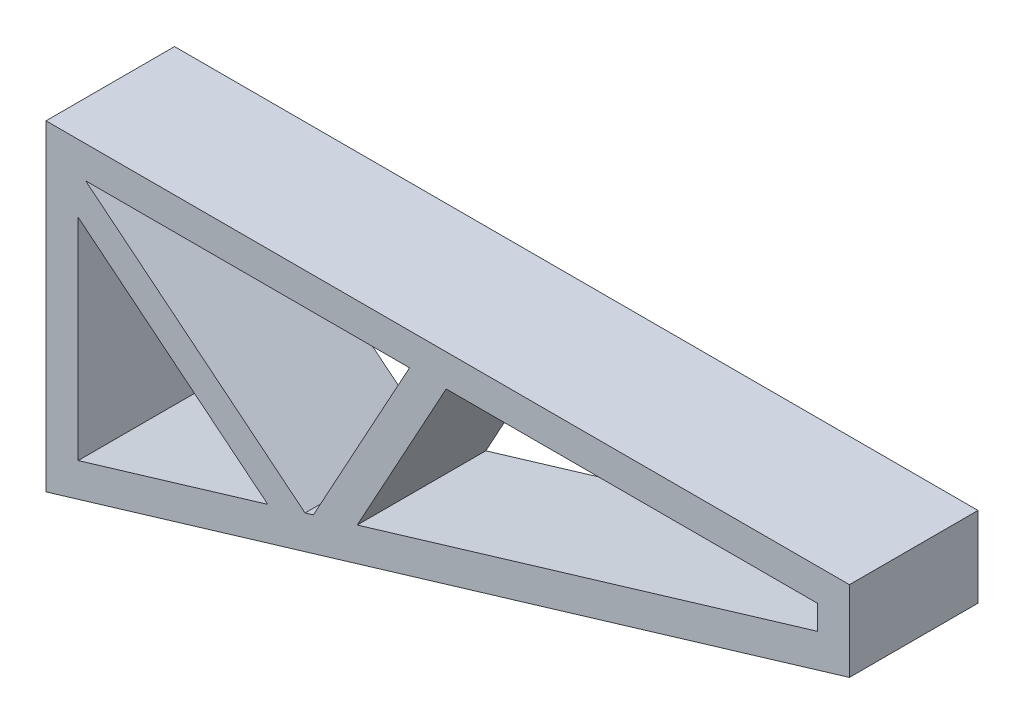
ISO-10303-21;
HEADER;
FILE_DESCRIPTION(('STEP AP214'),'2;1');
FILE_NAME('part.step','',(''),(''),'','','');
FILE_SCHEMA(('AUTOMOTIVE_DESIGN { 1 0 10303 214 1 1 1 1 }'));
ENDSEC;
DATA;
#1=APPLICATION_CONTEXT('core data for automotive mechanical design processes');
#2=APPLICATION_PROTOCOL_DEFINITION('international standard','automotive_design',2000,#1);
#3=PRODUCT_CONTEXT('',#1,'mechanical');
#4=PRODUCT('Part','Part','',(#3));
#5=PRODUCT_RELATED_PRODUCT_CATEGORY('part','',(#4));
#6=PRODUCT_DEFINITION_FORMATION('','',#4);
#7=PRODUCT_DEFINITION_CONTEXT('part definition',#1,'design');
#8=PRODUCT_DEFINITION('design','',#6,#7);
#9=PRODUCT_DEFINITION_SHAPE('','',#8);
#10=(LENGTH_UNIT() NAMED_UNIT(*) SI_UNIT(.MILLI.,.METRE.));
#11=(NAMED_UNIT(*) PLANE_ANGLE_UNIT() SI_UNIT($,.RADIAN.));
#12=(NAMED_UNIT(*) SI_UNIT($,.STERADIAN.) SOLID_ANGLE_UNIT());
#13=UNCERTAINTY_MEASURE_WITH_UNIT(LENGTH_MEASURE(1.E-05),#10,'distance_accuracy_value','');
#14=(GEOMETRIC_REPRESENTATION_CONTEXT(3) GLOBAL_UNCERTAINTY_ASSIGNED_CONTEXT((#13)) GLOBAL_UNIT_ASSIGNED_CONTEXT((#10,
#11,#12)) REPRESENTATION_CONTEXT('',''));
#15=CARTESIAN_POINT('',(0.,0.,0.));
#16=DIRECTION('',(0.,0.,1.));
#17=DIRECTION('',(1.,0.,0.));
#18=AXIS2_PLACEMENT_3D('',#15,#16,#17);
#19=CARTESIAN_POINT('',(42.6245438645254,52.5508075042094,20.));
#20=DIRECTION('',(0.629942664705403,0.77664164141762,0.));
#21=DIRECTION('',(-0.77664164141762,0.629942664705403,0.));
#22=AXIS2_PLACEMENT_3D('',#19,#20,#21);
#23=PLANE('',#22);
#24=DIRECTION('',(0.77664164141762,-0.629942664705403,0.));
#25=VECTOR('',#24,1.);
#26=CARTESIAN_POINT('',(42.6245438645254,52.5508075042094,-20.));
#27=LINE('',#26,#25);
#28=CARTESIAN_POINT('',(10.,79.0129375276578,-20.));
#29=VERTEX_POINT('',#28);
#30=CARTESIAN_POINT('',(69.0153679168725,31.1449168839723,-20.));
#31=VERTEX_POINT('',#30);
#32=EDGE_CURVE('E164',#29,#31,#27,.T.);
#33=ORIENTED_EDGE('',*,*,#32,.T.);
#34=DIRECTION('',(0.,0.,-1.));
#35=VECTOR('',#34,1.);
#36=CARTESIAN_POINT('',(69.0153679168725,31.1449168839723,20.));
#37=LINE('',#36,#35);
#38=CARTESIAN_POINT('',(69.0153679168725,31.1449168839723,20.));
#39=VERTEX_POINT('',#38);
#40=EDGE_CURVE('E12',#39,#31,#37,.T.);
#41=ORIENTED_EDGE('',*,*,#40,.F.);
#42=DIRECTION('',(0.77664164141762,-0.629942664705403,0.));
#43=VECTOR('',#42,1.);
#44=CARTESIAN_POINT('',(42.6245438645254,52.5508075042094,20.));
#45=LINE('',#44,#43);
#46=CARTESIAN_POINT('',(10.,79.0129375276578,20.));
#47=VERTEX_POINT('',#46);
#48=EDGE_CURVE('E154',#47,#39,#45,.T.);
#49=ORIENTED_EDGE('',*,*,#48,.F.);
#50=DIRECTION('',(0.,0.,-1.));
#51=VECTOR('',#50,1.);
#52=CARTESIAN_POINT('',(10.,79.0129375276578,20.));
#53=LINE('',#52,#51);
#54=EDGE_CURVE('E214',#47,#29,#53,.T.);
#55=ORIENTED_EDGE('',*,*,#54,.T.);
#56=EDGE_LOOP('',(#33,#41,#49,#55));
#57=FACE_BOUND('',#56,.T.);
#58=ADVANCED_FACE('F43',(#57),#23,.F.);
#59=CARTESIAN_POINT('',(-2.87347885566346,9.57826285221151,20.));
#60=DIRECTION('',(-0.287347885566345,0.957826285221151,0.));
#61=DIRECTION('',(-0.957826285221151,-0.287347885566345,0.));
#62=AXIS2_PLACEMENT_3D('',#59,#60,#61);
#63=PLANE('',#62);
#64=DIRECTION('',(0.957826285221151,0.287347885566345,0.));
#65=VECTOR('',#64,1.);
#66=CARTESIAN_POINT('',(-2.87347885566346,9.57826285221151,-20.));
#67=LINE('',#66,#65);
#68=CARTESIAN_POINT('',(10.,13.4403065089106,-20.));
#69=VERTEX_POINT('',#68);
#70=EDGE_CURVE('E210',#69,#31,#67,.T.);
#71=ORIENTED_EDGE('',*,*,#70,.F.);
#72=DIRECTION('',(0.,0.,-1.));
#73=VECTOR('',#72,1.);
#74=CARTESIAN_POINT('',(10.,13.4403065089106,20.));
#75=LINE('',#74,#73);
#76=CARTESIAN_POINT('',(10.,13.4403065089106,20.));
#77=VERTEX_POINT('',#76);
#78=EDGE_CURVE('E53',#77,#69,#75,.T.);
#79=ORIENTED_EDGE('',*,*,#78,.F.);
#80=DIRECTION('',(0.957826285221151,0.287347885566345,0.));
#81=VECTOR('',#80,1.);
#82=CARTESIAN_POINT('',(-2.87347885566346,9.57826285221151,20.));
#83=LINE('',#82,#81);
#84=EDGE_CURVE('E158',#77,#39,#83,.T.);
#85=ORIENTED_EDGE('',*,*,#84,.T.);
#86=ORIENTED_EDGE('',*,*,#40,.T.);
#87=EDGE_LOOP('',(#71,#79,#85,#86));
#88=FACE_BOUND('',#87,.T.);
#89=ADVANCED_FACE('F168',(#88),#63,.T.);
#90=CARTESIAN_POINT('',(0.,0.,20.));
#91=DIRECTION('',(-0.287347885566345,0.957826285221151,0.));
#92=DIRECTION('',(-0.957826285221151,-0.287347885566345,0.));
#93=AXIS2_PLACEMENT_3D('',#90,#91,#92);
#94=PLANE('',#93);
#95=DIRECTION('',(0.957826285221151,0.287347885566345,0.));
#96=VECTOR('',#95,1.);
#97=CARTESIAN_POINT('',(0.,0.,-20.));
#98=LINE('',#97,#96);
#99=CARTESIAN_POINT('',(0.,0.,-20.));
#100=VERTEX_POINT('',#99);
#101=CARTESIAN_POINT('',(250.,75.,-20.));
#102=VERTEX_POINT('',#101);
#103=EDGE_CURVE('E197',#100,#102,#98,.T.);
#104=ORIENTED_EDGE('',*,*,#103,.T.);
#105=DIRECTION('',(0.,0.,-1.));
#106=VECTOR('',#105,1.);
#107=CARTESIAN_POINT('',(250.,75.,20.));
#108=LINE('',#107,#106);
#109=CARTESIAN_POINT('',(250.,75.,20.));
#110=VERTEX_POINT('',#109);
#111=EDGE_CURVE('E216',#110,#102,#108,.T.);
#112=ORIENTED_EDGE('',*,*,#111,.F.);
#113=DIRECTION('',(0.957826285221151,0.287347885566345,0.));
#114=VECTOR('',#113,1.);
#115=CARTESIAN_POINT('',(0.,0.,20.));
#116=LINE('',#115,#114);
#117=CARTESIAN_POINT('',(0.,0.,20.));
#118=VERTEX_POINT('',#117);
#119=EDGE_CURVE('E465',#118,#110,#116,.T.);
#120=ORIENTED_EDGE('',*,*,#119,.F.);
#121=DIRECTION('',(0.,0.,-1.));
#122=VECTOR('',#121,1.);
#123=CARTESIAN_POINT('',(0.,0.,20.));
#124=LINE('',#123,#122);
#125=EDGE_CURVE('E218',#118,#100,#124,.T.);
#126=ORIENTED_EDGE('',*,*,#125,.T.);
#127=EDGE_LOOP('',(#104,#112,#120,#126));
#128=FACE_BOUND('',#127,.T.);
#129=ADVANCED_FACE('F274',(#128),#94,.F.);
#130=CARTESIAN_POINT('',(250.,0.,20.));
#131=DIRECTION('',(-1.,0.,0.));
#132=DIRECTION('',(0.,0.,1.));
#133=AXIS2_PLACEMENT_3D('',#130,#131,#132);
#134=PLANE('',#133);
#135=DIRECTION('',(0.,1.,0.));
#136=VECTOR('',#135,1.);
#137=CARTESIAN_POINT('',(250.,0.,-20.));
#138=LINE('',#137,#136);
#139=CARTESIAN_POINT('',(250.,100.,-20.));
#140=VERTEX_POINT('',#139);
#141=EDGE_CURVE('E200',#102,#140,#138,.T.);
#142=ORIENTED_EDGE('',*,*,#141,.T.);
#143=DIRECTION('',(0.,0.,-1.));
#144=VECTOR('',#143,1.);
#145=CARTESIAN_POINT('',(250.,100.,20.));
#146=LINE('',#145,#144);
#147=CARTESIAN_POINT('',(250.,100.,20.));
#148=VERTEX_POINT('',#147);
#149=EDGE_CURVE('E223',#148,#140,#146,.T.);
#150=ORIENTED_EDGE('',*,*,#149,.F.);
#151=DIRECTION('',(0.,1.,0.));
#152=VECTOR('',#151,1.);
#153=CARTESIAN_POINT('',(250.,0.,20.));
#154=LINE('',#153,#152);
#155=EDGE_CURVE('E468',#110,#148,#154,.T.);
#156=ORIENTED_EDGE('',*,*,#155,.F.);
#157=ORIENTED_EDGE('',*,*,#111,.T.);
#158=EDGE_LOOP('',(#142,#150,#156,#157));
#159=FACE_BOUND('',#158,.T.);
#160=ADVANCED_FACE('F282',(#159),#134,.F.);
#161=CARTESIAN_POINT('',(0.,100.,20.));
#162=DIRECTION('',(0.,1.,0.));
#163=DIRECTION('',(0.,0.,1.));
#164=AXIS2_PLACEMENT_3D('',#161,#162,#163);
#165=PLANE('',#164);
#166=DIRECTION('',(1.,0.,0.));
#167=VECTOR('',#166,1.);
#168=CARTESIAN_POINT('',(0.,100.,-20.));
#169=LINE('',#168,#167);
#170=CARTESIAN_POINT('',(0.,100.,-20.));
#171=VERTEX_POINT('',#170);
#172=EDGE_CURVE('E203',#171,#140,#169,.T.);
#173=ORIENTED_EDGE('',*,*,#172,.F.);
#174=DIRECTION('',(0.,0.,-1.));
#175=VECTOR('',#174,1.);
#176=CARTESIAN_POINT('',(0.,100.,20.));
#177=LINE('',#176,#175);
#178=CARTESIAN_POINT('',(0.,100.,20.));
#179=VERTEX_POINT('',#178);
#180=EDGE_CURVE('E220',#179,#171,#177,.T.);
#181=ORIENTED_EDGE('',*,*,#180,.F.);
#182=DIRECTION('',(1.,0.,0.));
#183=VECTOR('',#182,1.);
#184=CARTESIAN_POINT('',(0.,100.,20.));
#185=LINE('',#184,#183);
#186=EDGE_CURVE('E476',#179,#148,#185,.T.);
#187=ORIENTED_EDGE('',*,*,#186,.T.);
#188=ORIENTED_EDGE('',*,*,#149,.T.);
#189=EDGE_LOOP('',(#173,#181,#187,#188));
#190=FACE_BOUND('',#189,.T.);
#191=ADVANCED_FACE('F278',(#190),#165,.T.);
#192=CARTESIAN_POINT('',(-2.87347885566346,9.57826285221151,20.));
#193=DIRECTION('',(-0.287347885566345,0.957826285221151,0.));
#194=DIRECTION('',(-0.957826285221151,-0.287347885566345,0.));
#195=AXIS2_PLACEMENT_3D('',#192,#193,#194);
#196=PLANE('',#195);
#197=DIRECTION('',(0.957826285221151,0.287347885566345,0.));
#198=VECTOR('',#197,1.);
#199=CARTESIAN_POINT('',(-2.87347885566346,9.57826285221151,-20.));
#200=LINE('',#199,#198);
#201=CARTESIAN_POINT('',(80.6037241419805,34.6214237515047,-20.));
#202=VERTEX_POINT('',#201);
#203=CARTESIAN_POINT('',(83.2001001555763,35.4003365555834,-20.));
#204=VERTEX_POINT('',#203);
#205=EDGE_CURVE('E185',#202,#204,#200,.T.);
#206=ORIENTED_EDGE('',*,*,#205,.F.);
#207=DIRECTION('',(0.,0.,-1.));
#208=VECTOR('',#207,1.);
#209=CARTESIAN_POINT('',(80.6037241419805,34.6214237515047,20.));
#210=LINE('',#209,#208);
#211=CARTESIAN_POINT('',(80.6037241419805,34.6214237515047,20.));
#212=VERTEX_POINT('',#211);
#213=EDGE_CURVE('E221',#212,#202,#210,.T.);
#214=ORIENTED_EDGE('',*,*,#213,.F.);
#215=DIRECTION('',(0.957826285221151,0.287347885566345,0.));
#216=VECTOR('',#215,1.);
#217=CARTESIAN_POINT('',(-2.87347885566346,9.57826285221151,20.));
#218=LINE('',#217,#216);
#219=CARTESIAN_POINT('',(83.2001001555763,35.4003365555834,20.));
#220=VERTEX_POINT('',#219);
#221=EDGE_CURVE('E460',#212,#220,#218,.T.);
#222=ORIENTED_EDGE('',*,*,#221,.T.);
#223=DIRECTION('',(0.,0.,-1.));
#224=VECTOR('',#223,1.);
#225=CARTESIAN_POINT('',(83.2001001555763,35.4003365555834,20.));
#226=LINE('',#225,#224);
#227=EDGE_CURVE('E227',#220,#204,#226,.T.);
#228=ORIENTED_EDGE('',*,*,#227,.T.);
#229=EDGE_LOOP('',(#206,#214,#222,#228));
#230=FACE_BOUND('',#229,.T.);
#231=ADVANCED_FACE('F281',(#230),#196,.T.);
#232=CARTESIAN_POINT('',(48.9239705115794,60.3172239183856,20.));
#233=DIRECTION('',(0.629942664705403,0.77664164141762,0.));
#234=DIRECTION('',(-0.77664164141762,0.629942664705403,0.));
#235=AXIS2_PLACEMENT_3D('',#232,#233,#234);
#236=PLANE('',#235);
#237=DIRECTION('',(0.77664164141762,-0.629942664705403,0.));
#238=VECTOR('',#237,1.);
#239=CARTESIAN_POINT('',(48.9239705115794,60.3172239183856,-20.));
#240=LINE('',#239,#238);
#241=CARTESIAN_POINT('',(12.3287671232877,90.,-20.));
#242=VERTEX_POINT('',#241);
#243=EDGE_CURVE('E188',#242,#202,#240,.T.);
#244=ORIENTED_EDGE('',*,*,#243,.F.);
#245=DIRECTION('',(0.,0.,-1.));
#246=VECTOR('',#245,1.);
#247=CARTESIAN_POINT('',(12.3287671232877,90.,20.));
#248=LINE('',#247,#246);
#249=CARTESIAN_POINT('',(12.3287671232877,90.,20.));
#250=VERTEX_POINT('',#249);
#251=EDGE_CURVE('E231',#250,#242,#248,.T.);
#252=ORIENTED_EDGE('',*,*,#251,.F.);
#253=DIRECTION('',(0.77664164141762,-0.629942664705403,0.));
#254=VECTOR('',#253,1.);
#255=CARTESIAN_POINT('',(48.9239705115794,60.3172239183856,20.));
#256=LINE('',#255,#254);
#257=EDGE_CURVE('E488',#250,#212,#256,.T.);
#258=ORIENTED_EDGE('',*,*,#257,.T.);
#259=ORIENTED_EDGE('',*,*,#213,.T.);
#260=EDGE_LOOP('',(#244,#252,#258,#259));
#261=FACE_BOUND('',#260,.T.);
#262=ADVANCED_FACE('F296',(#261),#236,.T.);
#263=CARTESIAN_POINT('',(0.,90.,20.));
#264=DIRECTION('',(0.,1.,0.));
#265=DIRECTION('',(0.,0.,1.));
#266=AXIS2_PLACEMENT_3D('',#263,#264,#265);
#267=PLANE('',#266);
#268=DIRECTION('',(1.,0.,0.));
#269=VECTOR('',#268,1.);
#270=CARTESIAN_POINT('',(0.,90.,-20.));
#271=LINE('',#270,#269);
#272=CARTESIAN_POINT('',(113.117723960736,90.,-20.));
#273=VERTEX_POINT('',#272);
#274=EDGE_CURVE('E191',#242,#273,#271,.T.);
#275=ORIENTED_EDGE('',*,*,#274,.T.);
#276=DIRECTION('',(0.,0.,-1.));
#277=VECTOR('',#276,1.);
#278=CARTESIAN_POINT('',(113.117723960736,90.,20.));
#279=LINE('',#278,#277);
#280=CARTESIAN_POINT('',(113.117723960736,90.,20.));
#281=VERTEX_POINT('',#280);
#282=EDGE_CURVE('E229',#281,#273,#279,.T.);
#283=ORIENTED_EDGE('',*,*,#282,.F.);
#284=DIRECTION('',(1.,0.,0.));
#285=VECTOR('',#284,1.);
#286=CARTESIAN_POINT('',(0.,90.,20.));
#287=LINE('',#286,#285);
#288=EDGE_CURVE('E486',#250,#281,#287,.T.);
#289=ORIENTED_EDGE('',*,*,#288,.F.);
#290=ORIENTED_EDGE('',*,*,#251,.T.);
#291=EDGE_LOOP('',(#275,#283,#289,#290));
#292=FACE_BOUND('',#291,.T.);
#293=ADVANCED_FACE('F293',(#292),#267,.F.);
#294=CARTESIAN_POINT('',(-2.87347885566346,9.57826285221151,20.));
#295=DIRECTION('',(-0.287347885566345,0.957826285221151,0.));
#296=DIRECTION('',(-0.957826285221151,-0.287347885566345,0.));
#297=AXIS2_PLACEMENT_3D('',#294,#295,#296);
#298=PLANE('',#297);
#299=DIRECTION('',(0.957826285221151,0.287347885566345,0.));
#300=VECTOR('',#299,1.);
#301=CARTESIAN_POINT('',(-2.87347885566346,9.57826285221151,-20.));
#302=LINE('',#301,#300);
#303=CARTESIAN_POINT('',(96.8461026287938,39.4941372975487,-20.));
#304=VERTEX_POINT('',#303);
#305=CARTESIAN_POINT('',(240.,82.4403065089106,-20.));
#306=VERTEX_POINT('',#305);
#307=EDGE_CURVE('E174',#304,#306,#302,.T.);
#308=ORIENTED_EDGE('',*,*,#307,.F.);
#309=DIRECTION('',(0.,0.,-1.));
#310=VECTOR('',#309,1.);
#311=CARTESIAN_POINT('',(96.8461026287938,39.4941372975487,20.));
#312=LINE('',#311,#310);
#313=CARTESIAN_POINT('',(96.8461026287938,39.4941372975487,20.));
#314=VERTEX_POINT('',#313);
#315=EDGE_CURVE('E47',#314,#304,#312,.T.);
#316=ORIENTED_EDGE('',*,*,#315,.F.);
#317=DIRECTION('',(0.957826285221151,0.287347885566345,0.));
#318=VECTOR('',#317,1.);
#319=CARTESIAN_POINT('',(-2.87347885566346,9.57826285221151,20.));
#320=LINE('',#319,#318);
#321=CARTESIAN_POINT('',(240.,82.4403065089106,20.));
#322=VERTEX_POINT('',#321);
#323=EDGE_CURVE('E213',#314,#322,#320,.T.);
#324=ORIENTED_EDGE('',*,*,#323,.T.);
#325=DIRECTION('',(0.,0.,-1.));
#326=VECTOR('',#325,1.);
#327=CARTESIAN_POINT('',(240.,82.4403065089106,20.));
#328=LINE('',#327,#326);
#329=EDGE_CURVE('E170',#322,#306,#328,.T.);
#330=ORIENTED_EDGE('',*,*,#329,.T.);
#331=EDGE_LOOP('',(#308,#316,#324,#330));
#332=FACE_BOUND('',#331,.T.);
#333=ADVANCED_FACE('F45',(#332),#298,.T.);
#334=CARTESIAN_POINT('',(57.8395150815413,-31.692884976187,20.));
#335=DIRECTION('',(-0.876975739836019,0.480534651964942,0.));
#336=DIRECTION('',(-0.480534651964942,-0.876975739836019,0.));
#337=AXIS2_PLACEMENT_3D('',#334,#335,#336);
#338=PLANE('',#337);
#339=DIRECTION('',(0.480534651964942,0.876975739836019,0.));
#340=VECTOR('',#339,1.);
#341=CARTESIAN_POINT('',(57.8395150815413,-31.692884976187,-20.));
#342=LINE('',#341,#340);
#343=CARTESIAN_POINT('',(124.520547945205,90.,-20.));
#344=VERTEX_POINT('',#343);
#345=EDGE_CURVE('E177',#304,#344,#342,.T.);
#346=ORIENTED_EDGE('',*,*,#345,.T.);
#347=DIRECTION('',(0.,0.,-1.));
#348=VECTOR('',#347,1.);
#349=CARTESIAN_POINT('',(124.520547945205,90.,20.));
#350=LINE('',#349,#348);
#351=CARTESIAN_POINT('',(124.520547945205,90.,20.));
#352=VERTEX_POINT('',#351);
#353=EDGE_CURVE('E236',#352,#344,#350,.T.);
#354=ORIENTED_EDGE('',*,*,#353,.F.);
#355=DIRECTION('',(0.480534651964942,0.876975739836019,0.));
#356=VECTOR('',#355,1.);
#357=CARTESIAN_POINT('',(57.8395150815413,-31.692884976187,20.));
#358=LINE('',#357,#356);
#359=EDGE_CURVE('E245',#314,#352,#358,.T.);
#360=ORIENTED_EDGE('',*,*,#359,.F.);
#361=ORIENTED_EDGE('',*,*,#315,.T.);
#362=EDGE_LOOP('',(#346,#354,#360,#361));
#363=FACE_BOUND('',#362,.T.);
#364=ADVANCED_FACE('F244',(#363),#338,.F.);
#365=CARTESIAN_POINT('',(0.,90.,20.));
#366=DIRECTION('',(0.,1.,0.));
#367=DIRECTION('',(0.,0.,1.));
#368=AXIS2_PLACEMENT_3D('',#365,#366,#367);
#369=PLANE('',#368);
#370=DIRECTION('',(1.,0.,0.));
#371=VECTOR('',#370,1.);
#372=CARTESIAN_POINT('',(0.,90.,-20.));
#373=LINE('',#372,#371);
#374=CARTESIAN_POINT('',(240.,90.,-20.));
#375=VERTEX_POINT('',#374);
#376=EDGE_CURVE('E179',#344,#375,#373,.T.);
#377=ORIENTED_EDGE('',*,*,#376,.T.);
#378=DIRECTION('',(0.,0.,-1.));
#379=VECTOR('',#378,1.);
#380=CARTESIAN_POINT('',(240.,90.,20.));
#381=LINE('',#380,#379);
#382=CARTESIAN_POINT('',(240.,90.,20.));
#383=VERTEX_POINT('',#382);
#384=EDGE_CURVE('E235',#383,#375,#381,.T.);
#385=ORIENTED_EDGE('',*,*,#384,.F.);
#386=DIRECTION('',(1.,0.,0.));
#387=VECTOR('',#386,1.);
#388=CARTESIAN_POINT('',(0.,90.,20.));
#389=LINE('',#388,#387);
#390=EDGE_CURVE('E492',#352,#383,#389,.T.);
#391=ORIENTED_EDGE('',*,*,#390,.F.);
#392=ORIENTED_EDGE('',*,*,#353,.T.);
#393=EDGE_LOOP('',(#377,#385,#391,#392));
#394=FACE_BOUND('',#393,.T.);
#395=ADVANCED_FACE('F257',(#394),#369,.F.);
#396=CARTESIAN_POINT('',(0.,0.,20.));
#397=DIRECTION('',(-1.,0.,0.));
#398=DIRECTION('',(0.,0.,1.));
#399=AXIS2_PLACEMENT_3D('',#396,#397,#398);
#400=PLANE('',#399);
#401=DIRECTION('',(0.,1.,0.));
#402=VECTOR('',#401,1.);
#403=CARTESIAN_POINT('',(0.,0.,-20.));
#404=LINE('',#403,#402);
#405=EDGE_CURVE('E206',#100,#171,#404,.T.);
#406=ORIENTED_EDGE('',*,*,#405,.F.);
#407=ORIENTED_EDGE('',*,*,#125,.F.);
#408=DIRECTION('',(0.,1.,0.));
#409=VECTOR('',#408,1.);
#410=CARTESIAN_POINT('',(0.,0.,20.));
#411=LINE('',#410,#409);
#412=EDGE_CURVE('E160',#118,#179,#411,.T.);
#413=ORIENTED_EDGE('',*,*,#412,.T.);
#414=ORIENTED_EDGE('',*,*,#180,.T.);
#415=EDGE_LOOP('',(#406,#407,#413,#414));
#416=FACE_BOUND('',#415,.T.);
#417=ADVANCED_FACE('F259',(#416),#400,.T.);
#418=CARTESIAN_POINT('',(49.0697576831812,-26.8875384565376,20.));
#419=DIRECTION('',(-0.876975739836019,0.480534651964942,0.));
#420=DIRECTION('',(-0.480534651964942,-0.876975739836019,0.));
#421=AXIS2_PLACEMENT_3D('',#418,#419,#420);
#422=PLANE('',#421);
#423=DIRECTION('',(0.480534651964942,0.876975739836019,0.));
#424=VECTOR('',#423,1.);
#425=CARTESIAN_POINT('',(49.0697576831812,-26.8875384565376,-20.));
#426=LINE('',#425,#424);
#427=EDGE_CURVE('E194',#204,#273,#426,.T.);
#428=ORIENTED_EDGE('',*,*,#427,.F.);
#429=ORIENTED_EDGE('',*,*,#227,.F.);
#430=DIRECTION('',(0.480534651964942,0.876975739836019,0.));
#431=VECTOR('',#430,1.);
#432=CARTESIAN_POINT('',(49.0697576831812,-26.8875384565376,20.));
#433=LINE('',#432,#431);
#434=EDGE_CURVE('E471',#220,#281,#433,.T.);
#435=ORIENTED_EDGE('',*,*,#434,.T.);
#436=ORIENTED_EDGE('',*,*,#282,.T.);
#437=EDGE_LOOP('',(#428,#429,#435,#436));
#438=FACE_BOUND('',#437,.T.);
#439=ADVANCED_FACE('F265',(#438),#422,.T.);
#440=CARTESIAN_POINT('',(240.,0.,20.));
#441=DIRECTION('',(-1.,0.,0.));
#442=DIRECTION('',(0.,0.,1.));
#443=AXIS2_PLACEMENT_3D('',#440,#441,#442);
#444=PLANE('',#443);
#445=DIRECTION('',(0.,1.,0.));
#446=VECTOR('',#445,1.);
#447=CARTESIAN_POINT('',(240.,0.,-20.));
#448=LINE('',#447,#446);
#449=EDGE_CURVE('E182',#306,#375,#448,.T.);
#450=ORIENTED_EDGE('',*,*,#449,.F.);
#451=ORIENTED_EDGE('',*,*,#329,.F.);
#452=DIRECTION('',(0.,1.,0.));
#453=VECTOR('',#452,1.);
#454=CARTESIAN_POINT('',(240.,0.,20.));
#455=LINE('',#454,#453);
#456=EDGE_CURVE('E255',#322,#383,#455,.T.);
#457=ORIENTED_EDGE('',*,*,#456,.T.);
#458=ORIENTED_EDGE('',*,*,#384,.T.);
#459=EDGE_LOOP('',(#450,#451,#457,#458));
#460=FACE_BOUND('',#459,.T.);
#461=ADVANCED_FACE('F254',(#460),#444,.T.);
#462=CARTESIAN_POINT('',(10.,0.,20.));
#463=DIRECTION('',(-1.,0.,0.));
#464=DIRECTION('',(0.,0.,1.));
#465=AXIS2_PLACEMENT_3D('',#462,#463,#464);
#466=PLANE('',#465);
#467=DIRECTION('',(0.,1.,0.));
#468=VECTOR('',#467,1.);
#469=CARTESIAN_POINT('',(10.,0.,-20.));
#470=LINE('',#469,#468);
#471=EDGE_CURVE('E112',#69,#29,#470,.T.);
#472=ORIENTED_EDGE('',*,*,#471,.T.);
#473=ORIENTED_EDGE('',*,*,#54,.F.);
#474=DIRECTION('',(0.,1.,0.));
#475=VECTOR('',#474,1.);
#476=CARTESIAN_POINT('',(10.,0.,20.));
#477=LINE('',#476,#475);
#478=EDGE_CURVE('E62',#77,#47,#477,.T.);
#479=ORIENTED_EDGE('',*,*,#478,.F.);
#480=ORIENTED_EDGE('',*,*,#78,.T.);
#481=EDGE_LOOP('',(#472,#473,#479,#480));
#482=FACE_BOUND('',#481,.T.);
#483=ADVANCED_FACE('F304',(#482),#466,.F.);
#484=CARTESIAN_POINT('',(0.,0.,20.));
#485=DIRECTION('',(0.,0.,1.));
#486=DIRECTION('',(1.,0.,0.));
#487=AXIS2_PLACEMENT_3D('',#484,#485,#486);
#488=PLANE('',#487);
#489=ORIENTED_EDGE('',*,*,#323,.F.);
#490=ORIENTED_EDGE('',*,*,#359,.T.);
#491=ORIENTED_EDGE('',*,*,#390,.T.);
#492=ORIENTED_EDGE('',*,*,#456,.F.);
#493=EDGE_LOOP('',(#489,#490,#491,#492));
#494=FACE_BOUND('',#493,.T.);
#495=ORIENTED_EDGE('',*,*,#221,.F.);
#496=ORIENTED_EDGE('',*,*,#257,.F.);
#497=ORIENTED_EDGE('',*,*,#288,.T.);
#498=ORIENTED_EDGE('',*,*,#434,.F.);
#499=EDGE_LOOP('',(#495,#496,#497,#498));
#500=FACE_BOUND('',#499,.T.);
#501=ORIENTED_EDGE('',*,*,#119,.T.);
#502=ORIENTED_EDGE('',*,*,#155,.T.);
#503=ORIENTED_EDGE('',*,*,#186,.F.);
#504=ORIENTED_EDGE('',*,*,#412,.F.);
#505=EDGE_LOOP('',(#501,#502,#503,#504));
#506=FACE_BOUND('',#505,.T.);
#507=ORIENTED_EDGE('',*,*,#48,.T.);
#508=ORIENTED_EDGE('',*,*,#84,.F.);
#509=ORIENTED_EDGE('',*,*,#478,.T.);
#510=EDGE_LOOP('',(#507,#508,#509));
#511=FACE_BOUND('',#510,.T.);
#512=ADVANCED_FACE('F156',(#494,#500,#506,#511),#488,.T.);
#513=CARTESIAN_POINT('',(0.,0.,-20.));
#514=DIRECTION('',(0.,0.,1.));
#515=DIRECTION('',(1.,0.,0.));
#516=AXIS2_PLACEMENT_3D('',#513,#514,#515);
#517=PLANE('',#516);
#518=ORIENTED_EDGE('',*,*,#307,.T.);
#519=ORIENTED_EDGE('',*,*,#449,.T.);
#520=ORIENTED_EDGE('',*,*,#376,.F.);
#521=ORIENTED_EDGE('',*,*,#345,.F.);
#522=EDGE_LOOP('',(#518,#519,#520,#521));
#523=FACE_BOUND('',#522,.T.);
#524=ORIENTED_EDGE('',*,*,#205,.T.);
#525=ORIENTED_EDGE('',*,*,#427,.T.);
#526=ORIENTED_EDGE('',*,*,#274,.F.);
#527=ORIENTED_EDGE('',*,*,#243,.T.);
#528=EDGE_LOOP('',(#524,#525,#526,#527));
#529=FACE_BOUND('',#528,.T.);
#530=ORIENTED_EDGE('',*,*,#103,.F.);
#531=ORIENTED_EDGE('',*,*,#405,.T.);
#532=ORIENTED_EDGE('',*,*,#172,.T.);
#533=ORIENTED_EDGE('',*,*,#141,.F.);
#534=EDGE_LOOP('',(#530,#531,#532,#533));
#535=FACE_BOUND('',#534,.T.);
#536=ORIENTED_EDGE('',*,*,#32,.F.);
#537=ORIENTED_EDGE('',*,*,#471,.F.);
#538=ORIENTED_EDGE('',*,*,#70,.T.);
#539=EDGE_LOOP('',(#536,#537,#538));
#540=FACE_BOUND('',#539,.T.);
#541=ADVANCED_FACE('F248',(#523,#529,#535,#540),#517,.F.);
#542=CLOSED_SHELL('',(#58,#89,#129,#160,#191,#231,#262,#293,#333,#364,#395,#417,#439,#461,#483,
#512,#541));
#543=MANIFOLD_SOLID_BREP('B2',#542);
#544=ADVANCED_BREP_SHAPE_REPRESENTATION('',(#18,#543),#14);
#545=SHAPE_DEFINITION_REPRESENTATION(#9,#544);
ENDSEC;
END-ISO-10303-21;
